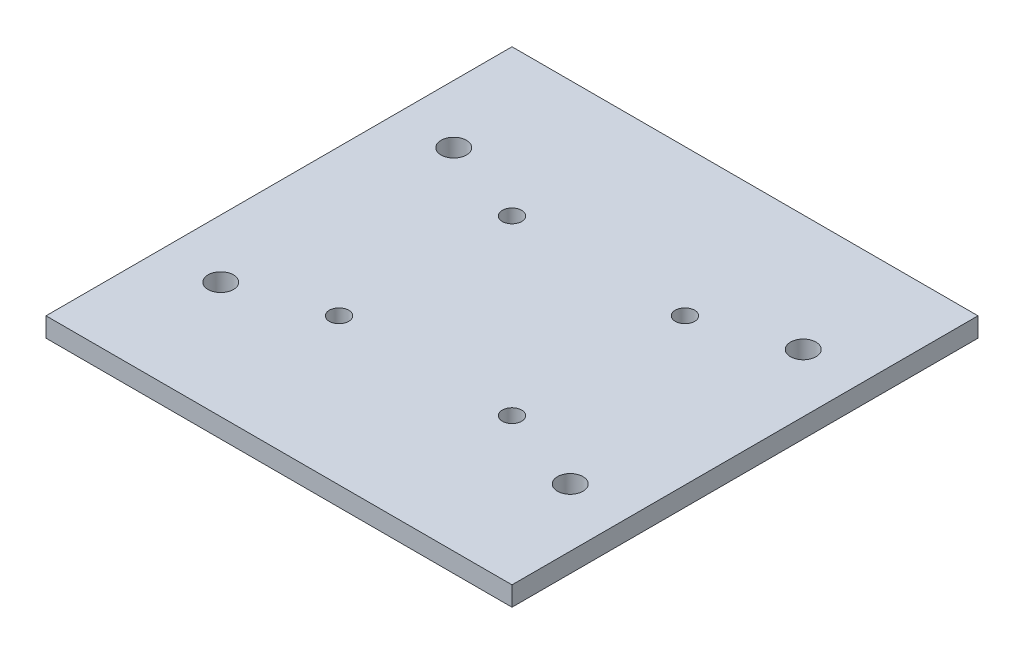
ISO-10303-21;
HEADER;
FILE_DESCRIPTION(('STEP AP214'),'2;1');
FILE_NAME('part.step','',(''),(''),'','','');
FILE_SCHEMA(('AUTOMOTIVE_DESIGN { 1 0 10303 214 1 1 1 1 }'));
ENDSEC;
DATA;
#1=APPLICATION_CONTEXT('core data for automotive mechanical design processes');
#2=APPLICATION_PROTOCOL_DEFINITION('international standard','automotive_design',2000,#1);
#3=PRODUCT_CONTEXT('',#1,'mechanical');
#4=PRODUCT('Part','Part','',(#3));
#5=PRODUCT_RELATED_PRODUCT_CATEGORY('part','',(#4));
#6=PRODUCT_DEFINITION_FORMATION('','',#4);
#7=PRODUCT_DEFINITION_CONTEXT('part definition',#1,'design');
#8=PRODUCT_DEFINITION('design','',#6,#7);
#9=PRODUCT_DEFINITION_SHAPE('','',#8);
#10=(LENGTH_UNIT() NAMED_UNIT(*) SI_UNIT(.MILLI.,.METRE.));
#11=(NAMED_UNIT(*) PLANE_ANGLE_UNIT() SI_UNIT($,.RADIAN.));
#12=(NAMED_UNIT(*) SI_UNIT($,.STERADIAN.) SOLID_ANGLE_UNIT());
#13=UNCERTAINTY_MEASURE_WITH_UNIT(LENGTH_MEASURE(1.E-05),#10,'distance_accuracy_value','');
#14=(GEOMETRIC_REPRESENTATION_CONTEXT(3) GLOBAL_UNCERTAINTY_ASSIGNED_CONTEXT((#13)) GLOBAL_UNIT_ASSIGNED_CONTEXT((#10,
#11,#12)) REPRESENTATION_CONTEXT('',''));
#15=CARTESIAN_POINT('',(0.,0.,0.));
#16=DIRECTION('',(0.,0.,1.));
#17=DIRECTION('',(1.,0.,0.));
#18=AXIS2_PLACEMENT_3D('',#15,#16,#17);
#19=CARTESIAN_POINT('',(0.,6.35,0.));
#20=DIRECTION('',(-1.,0.,0.));
#21=DIRECTION('',(0.,0.,1.));
#22=AXIS2_PLACEMENT_3D('',#19,#20,#21);
#23=PLANE('',#22);
#24=DIRECTION('',(0.,0.,-1.));
#25=VECTOR('',#24,1.);
#26=CARTESIAN_POINT('',(0.,0.,0.));
#27=LINE('',#26,#25);
#28=CARTESIAN_POINT('',(0.,0.,0.));
#29=VERTEX_POINT('',#28);
#30=CARTESIAN_POINT('',(0.,0.,-152.4));
#31=VERTEX_POINT('',#30);
#32=EDGE_CURVE('E109',#29,#31,#27,.T.);
#33=ORIENTED_EDGE('',*,*,#32,.F.);
#34=DIRECTION('',(0.,-1.,0.));
#35=VECTOR('',#34,1.);
#36=CARTESIAN_POINT('',(0.,6.35,0.));
#37=LINE('',#36,#35);
#38=CARTESIAN_POINT('',(0.,6.35,0.));
#39=VERTEX_POINT('',#38);
#40=EDGE_CURVE('E11',#39,#29,#37,.T.);
#41=ORIENTED_EDGE('',*,*,#40,.F.);
#42=DIRECTION('',(0.,0.,-1.));
#43=VECTOR('',#42,1.);
#44=CARTESIAN_POINT('',(0.,6.35,0.));
#45=LINE('',#44,#43);
#46=CARTESIAN_POINT('',(0.,6.35,-152.4));
#47=VERTEX_POINT('',#46);
#48=EDGE_CURVE('E103',#39,#47,#45,.T.);
#49=ORIENTED_EDGE('',*,*,#48,.T.);
#50=DIRECTION('',(0.,-1.,0.));
#51=VECTOR('',#50,1.);
#52=CARTESIAN_POINT('',(0.,6.35,-152.4));
#53=LINE('',#52,#51);
#54=EDGE_CURVE('E46',#47,#31,#53,.T.);
#55=ORIENTED_EDGE('',*,*,#54,.T.);
#56=EDGE_LOOP('',(#33,#41,#49,#55));
#57=FACE_BOUND('',#56,.T.);
#58=ADVANCED_FACE('F43',(#57),#23,.T.);
#59=CARTESIAN_POINT('',(0.,6.35,0.));
#60=DIRECTION('',(0.,0.,-1.));
#61=DIRECTION('',(-1.,0.,0.));
#62=AXIS2_PLACEMENT_3D('',#59,#60,#61);
#63=PLANE('',#62);
#64=DIRECTION('',(1.,0.,0.));
#65=VECTOR('',#64,1.);
#66=CARTESIAN_POINT('',(0.,0.,0.));
#67=LINE('',#66,#65);
#68=CARTESIAN_POINT('',(152.4,0.,0.));
#69=VERTEX_POINT('',#68);
#70=EDGE_CURVE('E76',#29,#69,#67,.T.);
#71=ORIENTED_EDGE('',*,*,#70,.T.);
#72=DIRECTION('',(0.,-1.,0.));
#73=VECTOR('',#72,1.);
#74=CARTESIAN_POINT('',(152.4,6.35,0.));
#75=LINE('',#74,#73);
#76=CARTESIAN_POINT('',(152.4,6.35,0.));
#77=VERTEX_POINT('',#76);
#78=EDGE_CURVE('E52',#77,#69,#75,.T.);
#79=ORIENTED_EDGE('',*,*,#78,.F.);
#80=DIRECTION('',(1.,0.,0.));
#81=VECTOR('',#80,1.);
#82=CARTESIAN_POINT('',(0.,6.35,0.));
#83=LINE('',#82,#81);
#84=EDGE_CURVE('E93',#39,#77,#83,.T.);
#85=ORIENTED_EDGE('',*,*,#84,.F.);
#86=ORIENTED_EDGE('',*,*,#40,.T.);
#87=EDGE_LOOP('',(#71,#79,#85,#86));
#88=FACE_BOUND('',#87,.T.);
#89=ADVANCED_FACE('F120',(#88),#63,.F.);
#90=CARTESIAN_POINT('',(152.4,6.35,0.));
#91=DIRECTION('',(-1.,0.,0.));
#92=DIRECTION('',(0.,0.,1.));
#93=AXIS2_PLACEMENT_3D('',#90,#91,#92);
#94=PLANE('',#93);
#95=DIRECTION('',(0.,0.,-1.));
#96=VECTOR('',#95,1.);
#97=CARTESIAN_POINT('',(152.4,0.,0.));
#98=LINE('',#97,#96);
#99=CARTESIAN_POINT('',(152.4,0.,-152.4));
#100=VERTEX_POINT('',#99);
#101=EDGE_CURVE('E100',#69,#100,#98,.T.);
#102=ORIENTED_EDGE('',*,*,#101,.T.);
#103=DIRECTION('',(0.,-1.,0.));
#104=VECTOR('',#103,1.);
#105=CARTESIAN_POINT('',(152.4,6.35,-152.4));
#106=LINE('',#105,#104);
#107=CARTESIAN_POINT('',(152.4,6.35,-152.4));
#108=VERTEX_POINT('',#107);
#109=EDGE_CURVE('E97',#108,#100,#106,.T.);
#110=ORIENTED_EDGE('',*,*,#109,.F.);
#111=DIRECTION('',(0.,0.,-1.));
#112=VECTOR('',#111,1.);
#113=CARTESIAN_POINT('',(152.4,6.35,0.));
#114=LINE('',#113,#112);
#115=EDGE_CURVE('E88',#77,#108,#114,.T.);
#116=ORIENTED_EDGE('',*,*,#115,.F.);
#117=ORIENTED_EDGE('',*,*,#78,.T.);
#118=EDGE_LOOP('',(#102,#110,#116,#117));
#119=FACE_BOUND('',#118,.T.);
#120=ADVANCED_FACE('F98',(#119),#94,.F.);
#121=CARTESIAN_POINT('',(0.,6.35,-152.4));
#122=DIRECTION('',(0.,0.,-1.));
#123=DIRECTION('',(-1.,0.,0.));
#124=AXIS2_PLACEMENT_3D('',#121,#122,#123);
#125=PLANE('',#124);
#126=DIRECTION('',(1.,0.,0.));
#127=VECTOR('',#126,1.);
#128=CARTESIAN_POINT('',(0.,0.,-152.4));
#129=LINE('',#128,#127);
#130=EDGE_CURVE('E112',#31,#100,#129,.T.);
#131=ORIENTED_EDGE('',*,*,#130,.F.);
#132=ORIENTED_EDGE('',*,*,#54,.F.);
#133=DIRECTION('',(1.,0.,0.));
#134=VECTOR('',#133,1.);
#135=CARTESIAN_POINT('',(0.,6.35,-152.4));
#136=LINE('',#135,#134);
#137=EDGE_CURVE('E92',#47,#108,#136,.T.);
#138=ORIENTED_EDGE('',*,*,#137,.T.);
#139=ORIENTED_EDGE('',*,*,#109,.T.);
#140=EDGE_LOOP('',(#131,#132,#138,#139));
#141=FACE_BOUND('',#140,.T.);
#142=ADVANCED_FACE('F102',(#141),#125,.T.);
#143=CARTESIAN_POINT('',(0.,6.35,0.));
#144=DIRECTION('',(0.,-1.,0.));
#145=DIRECTION('',(0.,0.,-1.));
#146=AXIS2_PLACEMENT_3D('',#143,#144,#145);
#147=PLANE('',#146);
#148=CARTESIAN_POINT('',(19.05,6.35,-114.3));
#149=DIRECTION('',(0.,-1.,0.));
#150=DIRECTION('',(0.,0.,-1.));
#151=AXIS2_PLACEMENT_3D('',#148,#149,#150);
#152=CIRCLE('',#151,4.1656);
#153=CARTESIAN_POINT('',(19.05,6.35,-118.4656));
#154=VERTEX_POINT('',#153);
#155=EDGE_CURVE('E113',#154,#154,#152,.T.);
#156=ORIENTED_EDGE('',*,*,#155,.T.);
#157=EDGE_LOOP('',(#156));
#158=FACE_BOUND('',#157,.T.);
#159=CARTESIAN_POINT('',(133.35,6.35,-114.3));
#160=DIRECTION('',(0.,-1.,0.));
#161=DIRECTION('',(0.,0.,-1.));
#162=AXIS2_PLACEMENT_3D('',#159,#160,#161);
#163=CIRCLE('',#162,4.1656);
#164=CARTESIAN_POINT('',(133.35,6.35,-118.4656));
#165=VERTEX_POINT('',#164);
#166=EDGE_CURVE('E197',#165,#165,#163,.T.);
#167=ORIENTED_EDGE('',*,*,#166,.T.);
#168=EDGE_LOOP('',(#167));
#169=FACE_BOUND('',#168,.T.);
#170=CARTESIAN_POINT('',(133.35,6.35,-38.1));
#171=DIRECTION('',(0.,-1.,0.));
#172=DIRECTION('',(0.,0.,-1.));
#173=AXIS2_PLACEMENT_3D('',#170,#171,#172);
#174=CIRCLE('',#173,4.1656);
#175=CARTESIAN_POINT('',(133.35,6.35,-42.2656));
#176=VERTEX_POINT('',#175);
#177=EDGE_CURVE('E188',#176,#176,#174,.T.);
#178=ORIENTED_EDGE('',*,*,#177,.T.);
#179=EDGE_LOOP('',(#178));
#180=FACE_BOUND('',#179,.T.);
#181=CARTESIAN_POINT('',(104.484271247462,6.35,-104.484271247462));
#182=DIRECTION('',(0.,-1.,0.));
#183=DIRECTION('',(0.,0.,-1.));
#184=AXIS2_PLACEMENT_3D('',#181,#182,#183);
#185=CIRCLE('',#184,3.175);
#186=CARTESIAN_POINT('',(104.484271247462,6.35,-107.659271247462));
#187=VERTEX_POINT('',#186);
#188=EDGE_CURVE('E184',#187,#187,#185,.T.);
#189=ORIENTED_EDGE('',*,*,#188,.T.);
#190=EDGE_LOOP('',(#189));
#191=FACE_BOUND('',#190,.T.);
#192=CARTESIAN_POINT('',(47.9157287525381,6.35,-47.9157287525382));
#193=DIRECTION('',(0.,-1.,0.));
#194=DIRECTION('',(0.,0.,-1.));
#195=AXIS2_PLACEMENT_3D('',#192,#193,#194);
#196=CIRCLE('',#195,3.175);
#197=CARTESIAN_POINT('',(47.9157287525381,6.35,-51.0907287525382));
#198=VERTEX_POINT('',#197);
#199=EDGE_CURVE('E182',#198,#198,#196,.T.);
#200=ORIENTED_EDGE('',*,*,#199,.T.);
#201=EDGE_LOOP('',(#200));
#202=FACE_BOUND('',#201,.T.);
#203=CARTESIAN_POINT('',(47.9157287525381,6.35,-104.484271247462));
#204=DIRECTION('',(0.,-1.,0.));
#205=DIRECTION('',(0.,0.,-1.));
#206=AXIS2_PLACEMENT_3D('',#203,#204,#205);
#207=CIRCLE('',#206,3.17499999999999);
#208=CARTESIAN_POINT('',(47.9157287525381,6.35,-107.659271247462));
#209=VERTEX_POINT('',#208);
#210=EDGE_CURVE('E185',#209,#209,#207,.T.);
#211=ORIENTED_EDGE('',*,*,#210,.T.);
#212=EDGE_LOOP('',(#211));
#213=FACE_BOUND('',#212,.T.);
#214=CARTESIAN_POINT('',(104.484271247462,6.35,-47.9157287525382));
#215=DIRECTION('',(0.,-1.,0.));
#216=DIRECTION('',(0.,0.,-1.));
#217=AXIS2_PLACEMENT_3D('',#214,#215,#216);
#218=CIRCLE('',#217,3.175);
#219=CARTESIAN_POINT('',(104.484271247462,6.35,-51.0907287525382));
#220=VERTEX_POINT('',#219);
#221=EDGE_CURVE('E191',#220,#220,#218,.T.);
#222=ORIENTED_EDGE('',*,*,#221,.T.);
#223=EDGE_LOOP('',(#222));
#224=FACE_BOUND('',#223,.T.);
#225=CARTESIAN_POINT('',(19.05,6.35,-38.1));
#226=DIRECTION('',(0.,-1.,0.));
#227=DIRECTION('',(0.,0.,-1.));
#228=AXIS2_PLACEMENT_3D('',#225,#226,#227);
#229=CIRCLE('',#228,4.1656);
#230=CARTESIAN_POINT('',(19.05,6.35,-42.2656));
#231=VERTEX_POINT('',#230);
#232=EDGE_CURVE('E215',#231,#231,#229,.T.);
#233=ORIENTED_EDGE('',*,*,#232,.T.);
#234=EDGE_LOOP('',(#233));
#235=FACE_BOUND('',#234,.T.);
#236=ORIENTED_EDGE('',*,*,#48,.F.);
#237=ORIENTED_EDGE('',*,*,#84,.T.);
#238=ORIENTED_EDGE('',*,*,#115,.T.);
#239=ORIENTED_EDGE('',*,*,#137,.F.);
#240=EDGE_LOOP('',(#236,#237,#238,#239));
#241=FACE_BOUND('',#240,.T.);
#242=ADVANCED_FACE('F91',(#158,#169,#180,#191,#202,#213,#224,#235,#241),#147,.F.);
#243=CARTESIAN_POINT('',(0.,0.,0.));
#244=DIRECTION('',(0.,-1.,0.));
#245=DIRECTION('',(0.,0.,-1.));
#246=AXIS2_PLACEMENT_3D('',#243,#244,#245);
#247=PLANE('',#246);
#248=CARTESIAN_POINT('',(19.05,0.,-114.3));
#249=DIRECTION('',(0.,1.,0.));
#250=DIRECTION('',(0.,0.,1.));
#251=AXIS2_PLACEMENT_3D('',#248,#249,#250);
#252=CIRCLE('',#251,4.1656);
#253=CARTESIAN_POINT('',(19.05,0.,-110.1344));
#254=VERTEX_POINT('',#253);
#255=EDGE_CURVE('E220',#254,#254,#252,.T.);
#256=ORIENTED_EDGE('',*,*,#255,.T.);
#257=EDGE_LOOP('',(#256));
#258=FACE_BOUND('',#257,.T.);
#259=CARTESIAN_POINT('',(133.35,0.,-114.3));
#260=DIRECTION('',(0.,1.,0.));
#261=DIRECTION('',(0.,0.,1.));
#262=AXIS2_PLACEMENT_3D('',#259,#260,#261);
#263=CIRCLE('',#262,4.1656);
#264=CARTESIAN_POINT('',(133.35,0.,-110.1344));
#265=VERTEX_POINT('',#264);
#266=EDGE_CURVE('E229',#265,#265,#263,.T.);
#267=ORIENTED_EDGE('',*,*,#266,.T.);
#268=EDGE_LOOP('',(#267));
#269=FACE_BOUND('',#268,.T.);
#270=CARTESIAN_POINT('',(133.35,0.,-38.1));
#271=DIRECTION('',(0.,1.,0.));
#272=DIRECTION('',(0.,0.,1.));
#273=AXIS2_PLACEMENT_3D('',#270,#271,#272);
#274=CIRCLE('',#273,4.1656);
#275=CARTESIAN_POINT('',(133.35,0.,-33.9344));
#276=VERTEX_POINT('',#275);
#277=EDGE_CURVE('E226',#276,#276,#274,.T.);
#278=ORIENTED_EDGE('',*,*,#277,.T.);
#279=EDGE_LOOP('',(#278));
#280=FACE_BOUND('',#279,.T.);
#281=CARTESIAN_POINT('',(104.484271247462,0.,-104.484271247462));
#282=DIRECTION('',(0.,1.,0.));
#283=DIRECTION('',(0.,0.,1.));
#284=AXIS2_PLACEMENT_3D('',#281,#282,#283);
#285=CIRCLE('',#284,3.175);
#286=CARTESIAN_POINT('',(104.484271247462,0.,-101.309271247462));
#287=VERTEX_POINT('',#286);
#288=EDGE_CURVE('E223',#287,#287,#285,.T.);
#289=ORIENTED_EDGE('',*,*,#288,.T.);
#290=EDGE_LOOP('',(#289));
#291=FACE_BOUND('',#290,.T.);
#292=CARTESIAN_POINT('',(47.9157287525381,0.,-47.9157287525382));
#293=DIRECTION('',(0.,1.,0.));
#294=DIRECTION('',(0.,0.,1.));
#295=AXIS2_PLACEMENT_3D('',#292,#293,#294);
#296=CIRCLE('',#295,3.175);
#297=CARTESIAN_POINT('',(47.9157287525381,0.,-44.7407287525382));
#298=VERTEX_POINT('',#297);
#299=EDGE_CURVE('E179',#298,#298,#296,.T.);
#300=ORIENTED_EDGE('',*,*,#299,.T.);
#301=EDGE_LOOP('',(#300));
#302=FACE_BOUND('',#301,.T.);
#303=CARTESIAN_POINT('',(47.9157287525381,0.,-104.484271247462));
#304=DIRECTION('',(0.,1.,0.));
#305=DIRECTION('',(0.,0.,1.));
#306=AXIS2_PLACEMENT_3D('',#303,#304,#305);
#307=CIRCLE('',#306,3.17499999999999);
#308=CARTESIAN_POINT('',(47.9157287525381,0.,-101.309271247462));
#309=VERTEX_POINT('',#308);
#310=EDGE_CURVE('E237',#309,#309,#307,.T.);
#311=ORIENTED_EDGE('',*,*,#310,.T.);
#312=EDGE_LOOP('',(#311));
#313=FACE_BOUND('',#312,.T.);
#314=CARTESIAN_POINT('',(104.484271247462,0.,-47.9157287525382));
#315=DIRECTION('',(0.,1.,0.));
#316=DIRECTION('',(0.,0.,1.));
#317=AXIS2_PLACEMENT_3D('',#314,#315,#316);
#318=CIRCLE('',#317,3.175);
#319=CARTESIAN_POINT('',(104.484271247462,0.,-44.7407287525382));
#320=VERTEX_POINT('',#319);
#321=EDGE_CURVE('E234',#320,#320,#318,.T.);
#322=ORIENTED_EDGE('',*,*,#321,.T.);
#323=EDGE_LOOP('',(#322));
#324=FACE_BOUND('',#323,.T.);
#325=CARTESIAN_POINT('',(19.05,0.,-38.1));
#326=DIRECTION('',(0.,1.,0.));
#327=DIRECTION('',(0.,0.,1.));
#328=AXIS2_PLACEMENT_3D('',#325,#326,#327);
#329=CIRCLE('',#328,4.1656);
#330=CARTESIAN_POINT('',(19.05,0.,-33.9344));
#331=VERTEX_POINT('',#330);
#332=EDGE_CURVE('E217',#331,#331,#329,.T.);
#333=ORIENTED_EDGE('',*,*,#332,.T.);
#334=EDGE_LOOP('',(#333));
#335=FACE_BOUND('',#334,.T.);
#336=ORIENTED_EDGE('',*,*,#32,.T.);
#337=ORIENTED_EDGE('',*,*,#130,.T.);
#338=ORIENTED_EDGE('',*,*,#101,.F.);
#339=ORIENTED_EDGE('',*,*,#70,.F.);
#340=EDGE_LOOP('',(#336,#337,#338,#339));
#341=FACE_BOUND('',#340,.T.);
#342=ADVANCED_FACE('F118',(#258,#269,#280,#291,#302,#313,#324,#335,#341),#247,.T.);
#343=CARTESIAN_POINT('',(19.05,0.,-38.1));
#344=DIRECTION('',(0.,1.,0.));
#345=DIRECTION('',(0.,0.,1.));
#346=AXIS2_PLACEMENT_3D('',#343,#344,#345);
#347=CYLINDRICAL_SURFACE('',#346,4.1656);
#348=ORIENTED_EDGE('',*,*,#332,.F.);
#349=EDGE_LOOP('',(#348));
#350=FACE_BOUND('',#349,.T.);
#351=ORIENTED_EDGE('',*,*,#232,.F.);
#352=EDGE_LOOP('',(#351));
#353=FACE_BOUND('',#352,.T.);
#354=ADVANCED_FACE('F139',(#350,#353),#347,.F.);
#355=CARTESIAN_POINT('',(104.484271247462,0.,-47.9157287525382));
#356=DIRECTION('',(0.,1.,0.));
#357=DIRECTION('',(0.,0.,1.));
#358=AXIS2_PLACEMENT_3D('',#355,#356,#357);
#359=CYLINDRICAL_SURFACE('',#358,3.175);
#360=ORIENTED_EDGE('',*,*,#321,.F.);
#361=EDGE_LOOP('',(#360));
#362=FACE_BOUND('',#361,.T.);
#363=ORIENTED_EDGE('',*,*,#221,.F.);
#364=EDGE_LOOP('',(#363));
#365=FACE_BOUND('',#364,.T.);
#366=ADVANCED_FACE('F146',(#362,#365),#359,.F.);
#367=CARTESIAN_POINT('',(47.9157287525381,0.,-104.484271247462));
#368=DIRECTION('',(0.,1.,0.));
#369=DIRECTION('',(0.,0.,1.));
#370=AXIS2_PLACEMENT_3D('',#367,#368,#369);
#371=CYLINDRICAL_SURFACE('',#370,3.17499999999999);
#372=ORIENTED_EDGE('',*,*,#310,.F.);
#373=EDGE_LOOP('',(#372));
#374=FACE_BOUND('',#373,.T.);
#375=ORIENTED_EDGE('',*,*,#210,.F.);
#376=EDGE_LOOP('',(#375));
#377=FACE_BOUND('',#376,.T.);
#378=ADVANCED_FACE('F167',(#374,#377),#371,.F.);
#379=CARTESIAN_POINT('',(47.9157287525381,0.,-47.9157287525382));
#380=DIRECTION('',(0.,1.,0.));
#381=DIRECTION('',(0.,0.,1.));
#382=AXIS2_PLACEMENT_3D('',#379,#380,#381);
#383=CYLINDRICAL_SURFACE('',#382,3.175);
#384=ORIENTED_EDGE('',*,*,#299,.F.);
#385=EDGE_LOOP('',(#384));
#386=FACE_BOUND('',#385,.T.);
#387=ORIENTED_EDGE('',*,*,#199,.F.);
#388=EDGE_LOOP('',(#387));
#389=FACE_BOUND('',#388,.T.);
#390=ADVANCED_FACE('F152',(#386,#389),#383,.F.);
#391=CARTESIAN_POINT('',(104.484271247462,0.,-104.484271247462));
#392=DIRECTION('',(0.,1.,0.));
#393=DIRECTION('',(0.,0.,1.));
#394=AXIS2_PLACEMENT_3D('',#391,#392,#393);
#395=CYLINDRICAL_SURFACE('',#394,3.175);
#396=ORIENTED_EDGE('',*,*,#288,.F.);
#397=EDGE_LOOP('',(#396));
#398=FACE_BOUND('',#397,.T.);
#399=ORIENTED_EDGE('',*,*,#188,.F.);
#400=EDGE_LOOP('',(#399));
#401=FACE_BOUND('',#400,.T.);
#402=ADVANCED_FACE('F148',(#398,#401),#395,.F.);
#403=CARTESIAN_POINT('',(133.35,0.,-38.1));
#404=DIRECTION('',(0.,1.,0.));
#405=DIRECTION('',(0.,0.,1.));
#406=AXIS2_PLACEMENT_3D('',#403,#404,#405);
#407=CYLINDRICAL_SURFACE('',#406,4.1656);
#408=ORIENTED_EDGE('',*,*,#277,.F.);
#409=EDGE_LOOP('',(#408));
#410=FACE_BOUND('',#409,.T.);
#411=ORIENTED_EDGE('',*,*,#177,.F.);
#412=EDGE_LOOP('',(#411));
#413=FACE_BOUND('',#412,.T.);
#414=ADVANCED_FACE('F151',(#410,#413),#407,.F.);
#415=CARTESIAN_POINT('',(133.35,0.,-114.3));
#416=DIRECTION('',(0.,1.,0.));
#417=DIRECTION('',(0.,0.,1.));
#418=AXIS2_PLACEMENT_3D('',#415,#416,#417);
#419=CYLINDRICAL_SURFACE('',#418,4.1656);
#420=ORIENTED_EDGE('',*,*,#266,.F.);
#421=EDGE_LOOP('',(#420));
#422=FACE_BOUND('',#421,.T.);
#423=ORIENTED_EDGE('',*,*,#166,.F.);
#424=EDGE_LOOP('',(#423));
#425=FACE_BOUND('',#424,.T.);
#426=ADVANCED_FACE('F156',(#422,#425),#419,.F.);
#427=CARTESIAN_POINT('',(19.05,0.,-114.3));
#428=DIRECTION('',(0.,1.,0.));
#429=DIRECTION('',(0.,0.,1.));
#430=AXIS2_PLACEMENT_3D('',#427,#428,#429);
#431=CYLINDRICAL_SURFACE('',#430,4.1656);
#432=ORIENTED_EDGE('',*,*,#255,.F.);
#433=EDGE_LOOP('',(#432));
#434=FACE_BOUND('',#433,.T.);
#435=ORIENTED_EDGE('',*,*,#155,.F.);
#436=EDGE_LOOP('',(#435));
#437=FACE_BOUND('',#436,.T.);
#438=ADVANCED_FACE('F160',(#434,#437),#431,.F.);
#439=CLOSED_SHELL('',(#58,#89,#120,#142,#242,#342,#354,#366,#378,#390,#402,#414,#426,#438));
#440=MANIFOLD_SOLID_BREP('B2',#439);
#441=ADVANCED_BREP_SHAPE_REPRESENTATION('',(#18,#440),#14);
#442=SHAPE_DEFINITION_REPRESENTATION(#9,#441);
ENDSEC;
END-ISO-10303-21;
